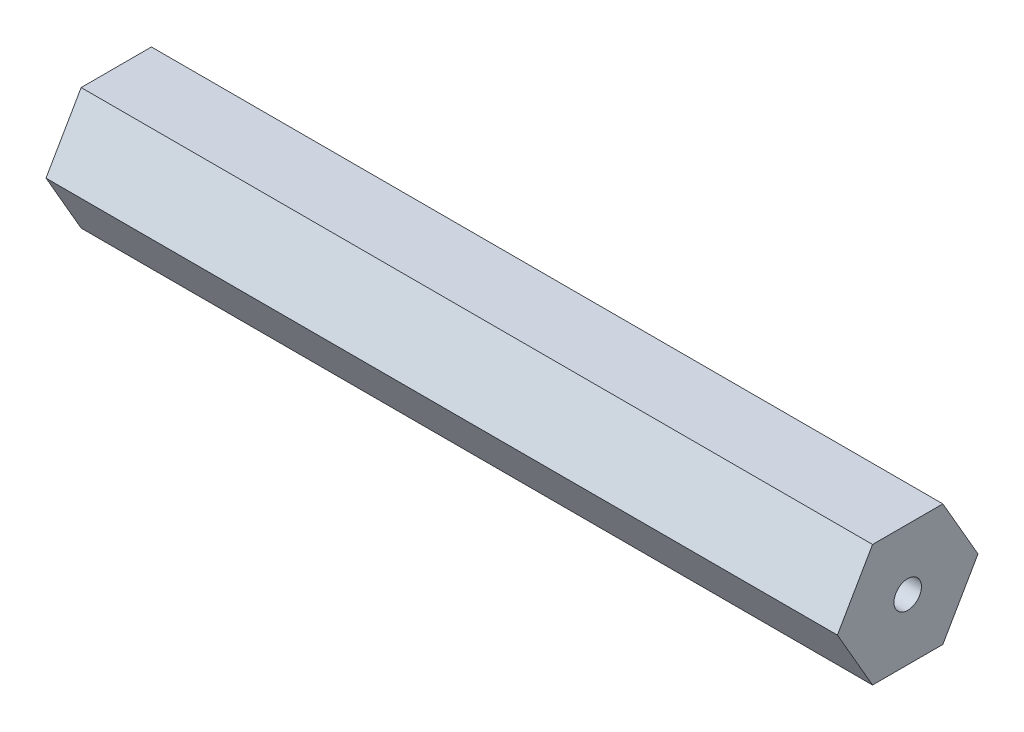
ISO-10303-21;
HEADER;
FILE_DESCRIPTION(('STEP AP214'),'2;1');
FILE_NAME('part.step','',(''),(''),'','','');
FILE_SCHEMA(('AUTOMOTIVE_DESIGN { 1 0 10303 214 1 1 1 1 }'));
ENDSEC;
DATA;
#1=APPLICATION_CONTEXT('core data for automotive mechanical design processes');
#2=APPLICATION_PROTOCOL_DEFINITION('international standard','automotive_design',2000,#1);
#3=PRODUCT_CONTEXT('',#1,'mechanical');
#4=PRODUCT('Part','Part','',(#3));
#5=PRODUCT_RELATED_PRODUCT_CATEGORY('part','',(#4));
#6=PRODUCT_DEFINITION_FORMATION('','',#4);
#7=PRODUCT_DEFINITION_CONTEXT('part definition',#1,'design');
#8=PRODUCT_DEFINITION('design','',#6,#7);
#9=PRODUCT_DEFINITION_SHAPE('','',#8);
#10=(LENGTH_UNIT() NAMED_UNIT(*) SI_UNIT(.MILLI.,.METRE.));
#11=(NAMED_UNIT(*) PLANE_ANGLE_UNIT() SI_UNIT($,.RADIAN.));
#12=(NAMED_UNIT(*) SI_UNIT($,.STERADIAN.) SOLID_ANGLE_UNIT());
#13=UNCERTAINTY_MEASURE_WITH_UNIT(LENGTH_MEASURE(1.E-05),#10,'distance_accuracy_value','');
#14=(GEOMETRIC_REPRESENTATION_CONTEXT(3) GLOBAL_UNCERTAINTY_ASSIGNED_CONTEXT((#13)) GLOBAL_UNIT_ASSIGNED_CONTEXT((#10,
#11,#12)) REPRESENTATION_CONTEXT('',''));
#15=CARTESIAN_POINT('',(0.,0.,0.));
#16=DIRECTION('',(0.,0.,1.));
#17=DIRECTION('',(1.,0.,0.));
#18=AXIS2_PLACEMENT_3D('',#15,#16,#17);
#19=CARTESIAN_POINT('',(82.55,0.,0.));
#20=DIRECTION('',(1.,0.,0.));
#21=DIRECTION('',(0.,0.,-1.));
#22=AXIS2_PLACEMENT_3D('',#19,#20,#21);
#23=PLANE('',#22);
#24=DIRECTION('',(0.,0.,-1.));
#25=VECTOR('',#24,1.);
#26=CARTESIAN_POINT('',(82.55,-6.35,3.66617420935413));
#27=LINE('',#26,#25);
#28=CARTESIAN_POINT('',(82.55,-6.35,3.66617420935413));
#29=VERTEX_POINT('',#28);
#30=CARTESIAN_POINT('',(82.55,-6.35,-3.66617420935412));
#31=VERTEX_POINT('',#30);
#32=EDGE_CURVE('E128',#29,#31,#27,.T.);
#33=ORIENTED_EDGE('',*,*,#32,.T.);
#34=DIRECTION('',(0.,0.866025403784438,-0.5));
#35=VECTOR('',#34,1.);
#36=CARTESIAN_POINT('',(82.55,-6.35,-3.66617420935412));
#37=LINE('',#36,#35);
#38=CARTESIAN_POINT('',(82.55,0.,-7.33234841870825));
#39=VERTEX_POINT('',#38);
#40=EDGE_CURVE('E86',#31,#39,#37,.T.);
#41=ORIENTED_EDGE('',*,*,#40,.T.);
#42=DIRECTION('',(0.,0.866025403784439,0.5));
#43=VECTOR('',#42,1.);
#44=CARTESIAN_POINT('',(82.55,0.,-7.33234841870825));
#45=LINE('',#44,#43);
#46=CARTESIAN_POINT('',(82.55,6.35,-3.66617420935412));
#47=VERTEX_POINT('',#46);
#48=EDGE_CURVE('E99',#39,#47,#45,.T.);
#49=ORIENTED_EDGE('',*,*,#48,.T.);
#50=DIRECTION('',(0.,0.,1.));
#51=VECTOR('',#50,1.);
#52=CARTESIAN_POINT('',(82.55,6.35,-3.66617420935412));
#53=LINE('',#52,#51);
#54=CARTESIAN_POINT('',(82.55,6.35,3.66617420935412));
#55=VERTEX_POINT('',#54);
#56=EDGE_CURVE('E93',#47,#55,#53,.T.);
#57=ORIENTED_EDGE('',*,*,#56,.T.);
#58=DIRECTION('',(0.,-0.866025403784438,0.5));
#59=VECTOR('',#58,1.);
#60=CARTESIAN_POINT('',(82.55,6.35,3.66617420935412));
#61=LINE('',#60,#59);
#62=CARTESIAN_POINT('',(82.55,0.,7.33234841870825));
#63=VERTEX_POINT('',#62);
#64=EDGE_CURVE('E97',#55,#63,#61,.T.);
#65=ORIENTED_EDGE('',*,*,#64,.T.);
#66=DIRECTION('',(0.,-0.866025403784439,-0.5));
#67=VECTOR('',#66,1.);
#68=CARTESIAN_POINT('',(82.55,0.,7.33234841870825));
#69=LINE('',#68,#67);
#70=EDGE_CURVE('E49',#63,#29,#69,.T.);
#71=ORIENTED_EDGE('',*,*,#70,.T.);
#72=EDGE_LOOP('',(#33,#41,#49,#57,#65,#71));
#73=FACE_BOUND('',#72,.T.);
#74=CARTESIAN_POINT('',(82.55,0.,0.));
#75=DIRECTION('',(1.,0.,0.));
#76=DIRECTION('',(0.,0.,-1.));
#77=AXIS2_PLACEMENT_3D('',#74,#75,#76);
#78=CIRCLE('',#77,1.43173818356817);
#79=CARTESIAN_POINT('',(82.55,0.,-1.43173818356817));
#80=VERTEX_POINT('',#79);
#81=EDGE_CURVE('E121',#80,#80,#78,.T.);
#82=ORIENTED_EDGE('',*,*,#81,.F.);
#83=EDGE_LOOP('',(#82));
#84=FACE_BOUND('',#83,.T.);
#85=ADVANCED_FACE('F32',(#73,#84),#23,.T.);
#86=CARTESIAN_POINT('',(0.,0.,0.));
#87=DIRECTION('',(1.,0.,0.));
#88=DIRECTION('',(0.,0.,-1.));
#89=AXIS2_PLACEMENT_3D('',#86,#87,#88);
#90=PLANE('',#89);
#91=DIRECTION('',(0.,0.,-1.));
#92=VECTOR('',#91,1.);
#93=CARTESIAN_POINT('',(0.,-6.35,3.66617420935413));
#94=LINE('',#93,#92);
#95=CARTESIAN_POINT('',(0.,-6.35,3.66617420935413));
#96=VERTEX_POINT('',#95);
#97=CARTESIAN_POINT('',(0.,-6.35,-3.66617420935412));
#98=VERTEX_POINT('',#97);
#99=EDGE_CURVE('E117',#96,#98,#94,.T.);
#100=ORIENTED_EDGE('',*,*,#99,.F.);
#101=DIRECTION('',(0.,-0.866025403784439,-0.5));
#102=VECTOR('',#101,1.);
#103=CARTESIAN_POINT('',(0.,0.,7.33234841870825));
#104=LINE('',#103,#102);
#105=CARTESIAN_POINT('',(0.,0.,7.33234841870825));
#106=VERTEX_POINT('',#105);
#107=EDGE_CURVE('E78',#106,#96,#104,.T.);
#108=ORIENTED_EDGE('',*,*,#107,.F.);
#109=DIRECTION('',(0.,-0.866025403784438,0.5));
#110=VECTOR('',#109,1.);
#111=CARTESIAN_POINT('',(0.,6.35,3.66617420935412));
#112=LINE('',#111,#110);
#113=CARTESIAN_POINT('',(0.,6.35,3.66617420935412));
#114=VERTEX_POINT('',#113);
#115=EDGE_CURVE('E72',#114,#106,#112,.T.);
#116=ORIENTED_EDGE('',*,*,#115,.F.);
#117=DIRECTION('',(0.,0.,1.));
#118=VECTOR('',#117,1.);
#119=CARTESIAN_POINT('',(0.,6.35,-3.66617420935412));
#120=LINE('',#119,#118);
#121=CARTESIAN_POINT('',(0.,6.35,-3.66617420935412));
#122=VERTEX_POINT('',#121);
#123=EDGE_CURVE('E107',#122,#114,#120,.T.);
#124=ORIENTED_EDGE('',*,*,#123,.F.);
#125=DIRECTION('',(0.,0.866025403784439,0.5));
#126=VECTOR('',#125,1.);
#127=CARTESIAN_POINT('',(0.,0.,-7.33234841870825));
#128=LINE('',#127,#126);
#129=CARTESIAN_POINT('',(0.,0.,-7.33234841870825));
#130=VERTEX_POINT('',#129);
#131=EDGE_CURVE('E123',#130,#122,#128,.T.);
#132=ORIENTED_EDGE('',*,*,#131,.F.);
#133=DIRECTION('',(0.,0.866025403784438,-0.5));
#134=VECTOR('',#133,1.);
#135=CARTESIAN_POINT('',(0.,-6.35,-3.66617420935412));
#136=LINE('',#135,#134);
#137=EDGE_CURVE('E120',#98,#130,#136,.T.);
#138=ORIENTED_EDGE('',*,*,#137,.F.);
#139=EDGE_LOOP('',(#100,#108,#116,#124,#132,#138));
#140=FACE_BOUND('',#139,.T.);
#141=CARTESIAN_POINT('',(0.,0.,0.));
#142=DIRECTION('',(1.,0.,0.));
#143=DIRECTION('',(0.,0.,-1.));
#144=AXIS2_PLACEMENT_3D('',#141,#142,#143);
#145=CIRCLE('',#144,1.43173818356817);
#146=CARTESIAN_POINT('',(0.,0.,-1.43173818356817));
#147=VERTEX_POINT('',#146);
#148=EDGE_CURVE('E221',#147,#147,#145,.T.);
#149=ORIENTED_EDGE('',*,*,#148,.T.);
#150=EDGE_LOOP('',(#149));
#151=FACE_BOUND('',#150,.T.);
#152=ADVANCED_FACE('F137',(#140,#151),#90,.F.);
#153=CARTESIAN_POINT('',(82.55,-6.35,3.66617420935413));
#154=DIRECTION('',(0.,1.,0.));
#155=DIRECTION('',(0.,0.,1.));
#156=AXIS2_PLACEMENT_3D('',#153,#154,#155);
#157=PLANE('',#156);
#158=ORIENTED_EDGE('',*,*,#99,.T.);
#159=DIRECTION('',(-1.,0.,0.));
#160=VECTOR('',#159,1.);
#161=CARTESIAN_POINT('',(82.55,-6.35,-3.66617420935412));
#162=LINE('',#161,#160);
#163=EDGE_CURVE('E11',#31,#98,#162,.T.);
#164=ORIENTED_EDGE('',*,*,#163,.F.);
#165=ORIENTED_EDGE('',*,*,#32,.F.);
#166=DIRECTION('',(-1.,0.,0.));
#167=VECTOR('',#166,1.);
#168=CARTESIAN_POINT('',(82.55,-6.35,3.66617420935413));
#169=LINE('',#168,#167);
#170=EDGE_CURVE('E113',#29,#96,#169,.T.);
#171=ORIENTED_EDGE('',*,*,#170,.T.);
#172=EDGE_LOOP('',(#158,#164,#165,#171));
#173=FACE_BOUND('',#172,.T.);
#174=ADVANCED_FACE('F34',(#173),#157,.F.);
#175=CARTESIAN_POINT('',(82.55,-6.35,-3.66617420935412));
#176=DIRECTION('',(0.,0.5,0.866025403784438));
#177=DIRECTION('',(0.,-0.866025403784438,0.5));
#178=AXIS2_PLACEMENT_3D('',#175,#176,#177);
#179=PLANE('',#178);
#180=ORIENTED_EDGE('',*,*,#137,.T.);
#181=DIRECTION('',(-1.,0.,0.));
#182=VECTOR('',#181,1.);
#183=CARTESIAN_POINT('',(82.55,0.,-7.33234841870825));
#184=LINE('',#183,#182);
#185=EDGE_CURVE('E41',#39,#130,#184,.T.);
#186=ORIENTED_EDGE('',*,*,#185,.F.);
#187=ORIENTED_EDGE('',*,*,#40,.F.);
#188=ORIENTED_EDGE('',*,*,#163,.T.);
#189=EDGE_LOOP('',(#180,#186,#187,#188));
#190=FACE_BOUND('',#189,.T.);
#191=ADVANCED_FACE('F162',(#190),#179,.F.);
#192=CARTESIAN_POINT('',(82.55,0.,-7.33234841870825));
#193=DIRECTION('',(0.,-0.5,0.866025403784439));
#194=DIRECTION('',(0.,-0.866025403784439,-0.5));
#195=AXIS2_PLACEMENT_3D('',#192,#193,#194);
#196=PLANE('',#195);
#197=ORIENTED_EDGE('',*,*,#131,.T.);
#198=DIRECTION('',(-1.,0.,0.));
#199=VECTOR('',#198,1.);
#200=CARTESIAN_POINT('',(82.55,6.35,-3.66617420935412));
#201=LINE('',#200,#199);
#202=EDGE_CURVE('E108',#47,#122,#201,.T.);
#203=ORIENTED_EDGE('',*,*,#202,.F.);
#204=ORIENTED_EDGE('',*,*,#48,.F.);
#205=ORIENTED_EDGE('',*,*,#185,.T.);
#206=EDGE_LOOP('',(#197,#203,#204,#205));
#207=FACE_BOUND('',#206,.T.);
#208=ADVANCED_FACE('F134',(#207),#196,.F.);
#209=CARTESIAN_POINT('',(82.55,6.35,-3.66617420935412));
#210=DIRECTION('',(0.,-1.,0.));
#211=DIRECTION('',(0.,0.,-1.));
#212=AXIS2_PLACEMENT_3D('',#209,#210,#211);
#213=PLANE('',#212);
#214=ORIENTED_EDGE('',*,*,#123,.T.);
#215=DIRECTION('',(-1.,0.,0.));
#216=VECTOR('',#215,1.);
#217=CARTESIAN_POINT('',(82.55,6.35,3.66617420935412));
#218=LINE('',#217,#216);
#219=EDGE_CURVE('E104',#55,#114,#218,.T.);
#220=ORIENTED_EDGE('',*,*,#219,.F.);
#221=ORIENTED_EDGE('',*,*,#56,.F.);
#222=ORIENTED_EDGE('',*,*,#202,.T.);
#223=EDGE_LOOP('',(#214,#220,#221,#222));
#224=FACE_BOUND('',#223,.T.);
#225=ADVANCED_FACE('F105',(#224),#213,.F.);
#226=CARTESIAN_POINT('',(82.55,6.35,3.66617420935412));
#227=DIRECTION('',(0.,-0.5,-0.866025403784438));
#228=DIRECTION('',(0.,0.866025403784438,-0.5));
#229=AXIS2_PLACEMENT_3D('',#226,#227,#228);
#230=PLANE('',#229);
#231=ORIENTED_EDGE('',*,*,#115,.T.);
#232=DIRECTION('',(-1.,0.,0.));
#233=VECTOR('',#232,1.);
#234=CARTESIAN_POINT('',(82.55,0.,7.33234841870825));
#235=LINE('',#234,#233);
#236=EDGE_CURVE('E109',#63,#106,#235,.T.);
#237=ORIENTED_EDGE('',*,*,#236,.F.);
#238=ORIENTED_EDGE('',*,*,#64,.F.);
#239=ORIENTED_EDGE('',*,*,#219,.T.);
#240=EDGE_LOOP('',(#231,#237,#238,#239));
#241=FACE_BOUND('',#240,.T.);
#242=ADVANCED_FACE('F111',(#241),#230,.F.);
#243=CARTESIAN_POINT('',(82.55,0.,7.33234841870825));
#244=DIRECTION('',(0.,0.5,-0.866025403784439));
#245=DIRECTION('',(0.,0.866025403784439,0.5));
#246=AXIS2_PLACEMENT_3D('',#243,#244,#245);
#247=PLANE('',#246);
#248=ORIENTED_EDGE('',*,*,#107,.T.);
#249=ORIENTED_EDGE('',*,*,#170,.F.);
#250=ORIENTED_EDGE('',*,*,#70,.F.);
#251=ORIENTED_EDGE('',*,*,#236,.T.);
#252=EDGE_LOOP('',(#248,#249,#250,#251));
#253=FACE_BOUND('',#252,.T.);
#254=ADVANCED_FACE('F142',(#253),#247,.F.);
#255=CARTESIAN_POINT('',(82.55,0.,0.));
#256=DIRECTION('',(-1.,0.,0.));
#257=DIRECTION('',(0.,0.,1.));
#258=AXIS2_PLACEMENT_3D('',#255,#256,#257);
#259=CYLINDRICAL_SURFACE('',#258,1.43173818356817);
#260=ORIENTED_EDGE('',*,*,#81,.T.);
#261=EDGE_LOOP('',(#260));
#262=FACE_BOUND('',#261,.T.);
#263=ORIENTED_EDGE('',*,*,#148,.F.);
#264=EDGE_LOOP('',(#263));
#265=FACE_BOUND('',#264,.T.);
#266=ADVANCED_FACE('F144',(#262,#265),#259,.F.);
#267=CLOSED_SHELL('',(#85,#152,#174,#191,#208,#225,#242,#254,#266));
#268=MANIFOLD_SOLID_BREP('B2',#267);
#269=ADVANCED_BREP_SHAPE_REPRESENTATION('',(#18,#268),#14);
#270=SHAPE_DEFINITION_REPRESENTATION(#9,#269);
ENDSEC;
END-ISO-10303-21;
